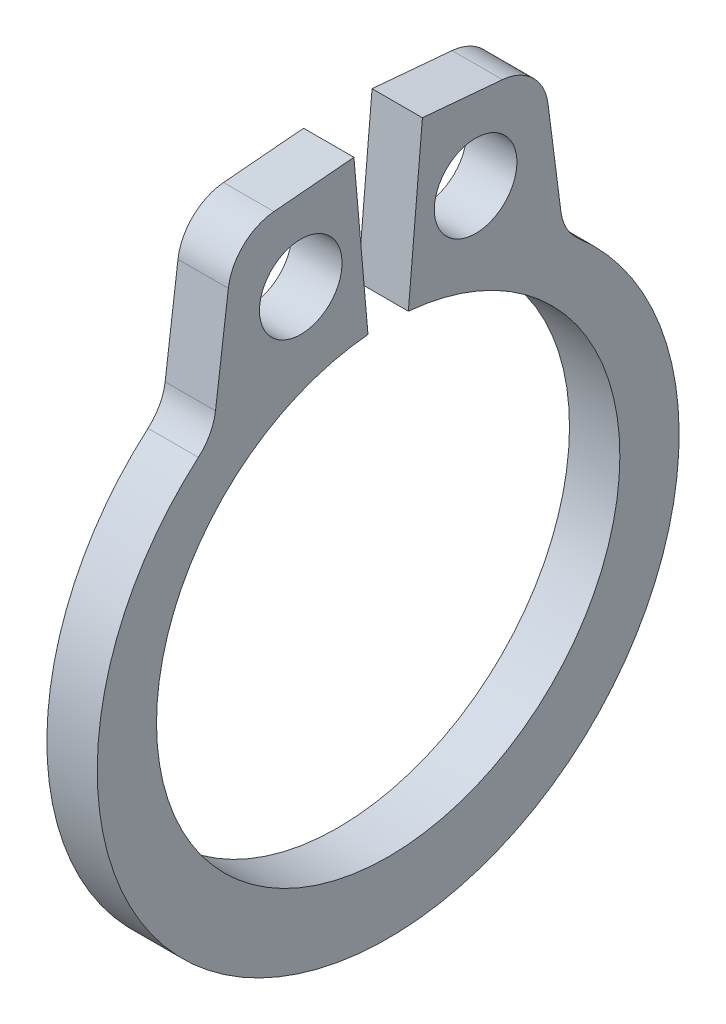
ISO-10303-21;
HEADER;
FILE_DESCRIPTION(('STEP AP214'),'2;1');
FILE_NAME('part.step','',(''),(''),'','','');
FILE_SCHEMA(('AUTOMOTIVE_DESIGN { 1 0 10303 214 1 1 1 1 }'));
ENDSEC;
DATA;
#1=APPLICATION_CONTEXT('core data for automotive mechanical design processes');
#2=APPLICATION_PROTOCOL_DEFINITION('international standard','automotive_design',2000,#1);
#3=PRODUCT_CONTEXT('',#1,'mechanical');
#4=PRODUCT('Part','Part','',(#3));
#5=PRODUCT_RELATED_PRODUCT_CATEGORY('part','',(#4));
#6=PRODUCT_DEFINITION_FORMATION('','',#4);
#7=PRODUCT_DEFINITION_CONTEXT('part definition',#1,'design');
#8=PRODUCT_DEFINITION('design','',#6,#7);
#9=PRODUCT_DEFINITION_SHAPE('','',#8);
#10=(LENGTH_UNIT() NAMED_UNIT(*) SI_UNIT(.MILLI.,.METRE.));
#11=(NAMED_UNIT(*) PLANE_ANGLE_UNIT() SI_UNIT($,.RADIAN.));
#12=(NAMED_UNIT(*) SI_UNIT($,.STERADIAN.) SOLID_ANGLE_UNIT());
#13=UNCERTAINTY_MEASURE_WITH_UNIT(LENGTH_MEASURE(1.E-05),#10,'distance_accuracy_value','');
#14=(GEOMETRIC_REPRESENTATION_CONTEXT(3) GLOBAL_UNCERTAINTY_ASSIGNED_CONTEXT((#13)) GLOBAL_UNIT_ASSIGNED_CONTEXT((#10,
#11,#12)) REPRESENTATION_CONTEXT('',''));
#15=CARTESIAN_POINT('',(0.,0.,0.));
#16=DIRECTION('',(0.,0.,1.));
#17=DIRECTION('',(1.,0.,0.));
#18=AXIS2_PLACEMENT_3D('',#15,#16,#17);
#19=CARTESIAN_POINT('',(-0.3175,0.,0.));
#20=DIRECTION('',(1.,0.,0.));
#21=DIRECTION('',(0.,0.,-1.));
#22=AXIS2_PLACEMENT_3D('',#19,#20,#21);
#23=PLANE('',#22);
#24=CARTESIAN_POINT('',(-0.3175,3.85560585041349,-1.10223251914344));
#25=DIRECTION('',(-1.,0.,0.));
#26=DIRECTION('',(0.,0.,1.));
#27=AXIS2_PLACEMENT_3D('',#24,#25,#26);
#28=CIRCLE('',#27,0.5207);
#29=CARTESIAN_POINT('',(-0.3175,3.85560585041349,-0.581532519143441));
#30=VERTEX_POINT('',#29);
#31=EDGE_CURVE('E132',#30,#30,#28,.F.);
#32=ORIENTED_EDGE('',*,*,#31,.T.);
#33=EDGE_LOOP('',(#32));
#34=FACE_BOUND('',#33,.T.);
#35=CARTESIAN_POINT('',(-0.3175,4.21328151857243,1.38546567126182));
#36=DIRECTION('',(-1.,0.,0.));
#37=DIRECTION('',(0.,0.,1.));
#38=AXIS2_PLACEMENT_3D('',#35,#36,#37);
#39=CIRCLE('',#38,0.635);
#40=CARTESIAN_POINT('',(-0.3175,4.84586515186069,1.44080956790658));
#41=VERTEX_POINT('',#40);
#42=CARTESIAN_POINT('',(-0.3175,4.2945067237745,2.01524933732492));
#43=VERTEX_POINT('',#42);
#44=EDGE_CURVE('E102',#41,#43,#39,.F.);
#45=ORIENTED_EDGE('',*,*,#44,.F.);
#46=DIRECTION('',(0.,0.0871557427476587,-0.996194698091746));
#47=VECTOR('',#46,1.);
#48=CARTESIAN_POINT('',(-0.3175,4.93415233964842,0.431682393829152));
#49=LINE('',#48,#47);
#50=CARTESIAN_POINT('',(-0.3175,4.93415233964842,0.431682393829152));
#51=VERTEX_POINT('',#50);
#52=EDGE_CURVE('E97',#41,#51,#49,.T.);
#53=ORIENTED_EDGE('',*,*,#52,.T.);
#54=DIRECTION('',(0.,-0.996194698091746,-0.0871557427476584));
#55=VECTOR('',#54,1.);
#56=CARTESIAN_POINT('',(-0.3175,2.90988471312599,0.25458192456591));
#57=LINE('',#56,#55);
#58=CARTESIAN_POINT('',(-0.3175,2.90988471312599,0.25458192456591));
#59=VERTEX_POINT('',#58);
#60=EDGE_CURVE('E129',#51,#59,#57,.T.);
#61=ORIENTED_EDGE('',*,*,#60,.T.);
#62=CARTESIAN_POINT('',(-0.3175,0.,0.));
#63=DIRECTION('',(-1.,0.,0.));
#64=DIRECTION('',(0.,0.,1.));
#65=AXIS2_PLACEMENT_3D('',#62,#63,#64);
#66=CIRCLE('',#65,2.921);
#67=CARTESIAN_POINT('',(-0.3175,2.90988471312599,-0.25458192456591));
#68=VERTEX_POINT('',#67);
#69=EDGE_CURVE('E179',#59,#68,#66,.F.);
#70=ORIENTED_EDGE('',*,*,#69,.T.);
#71=DIRECTION('',(0.,0.996194698091746,-0.0871557427476584));
#72=VECTOR('',#71,1.);
#73=CARTESIAN_POINT('',(-0.3175,2.90988471312599,-0.25458192456591));
#74=LINE('',#73,#72);
#75=CARTESIAN_POINT('',(-0.3175,4.93415233964842,-0.431682393829152));
#76=VERTEX_POINT('',#75);
#77=EDGE_CURVE('E139',#68,#76,#74,.T.);
#78=ORIENTED_EDGE('',*,*,#77,.T.);
#79=DIRECTION('',(0.,-0.0871557427476587,-0.996194698091746));
#80=VECTOR('',#79,1.);
#81=CARTESIAN_POINT('',(-0.3175,4.93415233964842,-0.431682393829152));
#82=LINE('',#81,#80);
#83=CARTESIAN_POINT('',(-0.3175,4.84586515186069,-1.44080956790658));
#84=VERTEX_POINT('',#83);
#85=EDGE_CURVE('E146',#76,#84,#82,.T.);
#86=ORIENTED_EDGE('',*,*,#85,.T.);
#87=CARTESIAN_POINT('',(-0.3175,4.21328151857243,-1.38546567126182));
#88=DIRECTION('',(-1.,0.,0.));
#89=DIRECTION('',(0.,0.,1.));
#90=AXIS2_PLACEMENT_3D('',#87,#88,#89);
#91=CIRCLE('',#90,0.635);
#92=CARTESIAN_POINT('',(-0.3175,4.2945067237745,-2.01524933732492));
#93=VERTEX_POINT('',#92);
#94=EDGE_CURVE('E149',#93,#84,#91,.F.);
#95=ORIENTED_EDGE('',*,*,#94,.F.);
#96=DIRECTION('',(0.,-0.991785300886776,-0.127913708979639));
#97=VECTOR('',#96,1.);
#98=CARTESIAN_POINT('',(-0.3175,4.80132698770098,-1.94988311372097));
#99=LINE('',#98,#97);
#100=CARTESIAN_POINT('',(-0.3175,3.03853740820642,-2.17723570007429));
#101=VERTEX_POINT('',#100);
#102=EDGE_CURVE('E152',#93,#101,#99,.T.);
#103=ORIENTED_EDGE('',*,*,#102,.T.);
#104=CARTESIAN_POINT('',(-0.3175,3.11976261340849,-2.80701936613739));
#105=DIRECTION('',(-1.,0.,0.));
#106=DIRECTION('',(0.,0.,1.));
#107=AXIS2_PLACEMENT_3D('',#104,#105,#106);
#108=CIRCLE('',#107,0.635);
#109=CARTESIAN_POINT('',(-0.3175,2.63846487393826,-2.39280023816181));
#110=VERTEX_POINT('',#109);
#111=EDGE_CURVE('E185',#101,#110,#108,.F.);
#112=ORIENTED_EDGE('',*,*,#111,.T.);
#113=CARTESIAN_POINT('',(-0.3175,-0.141825237867011,0.));
#114=DIRECTION('',(-1.,0.,0.));
#115=DIRECTION('',(0.,0.,1.));
#116=AXIS2_PLACEMENT_3D('',#113,#114,#115);
#117=CIRCLE('',#116,3.66817476213299);
#118=CARTESIAN_POINT('',(-0.3175,2.63846487393826,2.39280023816181));
#119=VERTEX_POINT('',#118);
#120=EDGE_CURVE('E187',#119,#110,#117,.F.);
#121=ORIENTED_EDGE('',*,*,#120,.F.);
#122=CARTESIAN_POINT('',(-0.3175,3.11976261340849,2.80701936613739));
#123=DIRECTION('',(-1.,0.,0.));
#124=DIRECTION('',(0.,0.,1.));
#125=AXIS2_PLACEMENT_3D('',#122,#123,#124);
#126=CIRCLE('',#125,0.635);
#127=CARTESIAN_POINT('',(-0.3175,3.03853740820642,2.17723570007429));
#128=VERTEX_POINT('',#127);
#129=EDGE_CURVE('E115',#119,#128,#126,.F.);
#130=ORIENTED_EDGE('',*,*,#129,.T.);
#131=DIRECTION('',(0.,0.991785300886776,-0.127913708979639));
#132=VECTOR('',#131,1.);
#133=CARTESIAN_POINT('',(-0.3175,4.80132698770098,1.94988311372097));
#134=LINE('',#133,#132);
#135=EDGE_CURVE('E112',#128,#43,#134,.T.);
#136=ORIENTED_EDGE('',*,*,#135,.T.);
#137=EDGE_LOOP('',(#45,#53,#61,#70,#78,#86,#95,#103,#112,#121,#130,#136));
#138=FACE_BOUND('',#137,.T.);
#139=CARTESIAN_POINT('',(-0.3175,3.85560585041349,1.10223251914344));
#140=DIRECTION('',(-1.,0.,0.));
#141=DIRECTION('',(0.,0.,1.));
#142=AXIS2_PLACEMENT_3D('',#139,#140,#141);
#143=CIRCLE('',#142,0.5207);
#144=CARTESIAN_POINT('',(-0.3175,3.85560585041349,1.62293251914344));
#145=VERTEX_POINT('',#144);
#146=EDGE_CURVE('E19',#145,#145,#143,.F.);
#147=ORIENTED_EDGE('',*,*,#146,.T.);
#148=EDGE_LOOP('',(#147));
#149=FACE_BOUND('',#148,.T.);
#150=ADVANCED_FACE('F16',(#34,#138,#149),#23,.F.);
#151=CARTESIAN_POINT('',(0.3175,3.85560585041349,1.10223251914344));
#152=DIRECTION('',(-1.,0.,0.));
#153=DIRECTION('',(0.,0.,1.));
#154=AXIS2_PLACEMENT_3D('',#151,#152,#153);
#155=CYLINDRICAL_SURFACE('',#154,0.5207);
#156=CARTESIAN_POINT('',(0.3175,3.85560585041349,1.10223251914344));
#157=DIRECTION('',(-1.,0.,0.));
#158=DIRECTION('',(0.,0.,1.));
#159=AXIS2_PLACEMENT_3D('',#156,#157,#158);
#160=CIRCLE('',#159,0.5207);
#161=CARTESIAN_POINT('',(0.3175,3.85560585041349,1.62293251914344));
#162=VERTEX_POINT('',#161);
#163=EDGE_CURVE('E174',#162,#162,#160,.T.);
#164=ORIENTED_EDGE('',*,*,#163,.F.);
#165=EDGE_LOOP('',(#164));
#166=FACE_BOUND('',#165,.T.);
#167=ORIENTED_EDGE('',*,*,#146,.F.);
#168=EDGE_LOOP('',(#167));
#169=FACE_BOUND('',#168,.T.);
#170=ADVANCED_FACE('F387',(#166,#169),#155,.F.);
#171=CARTESIAN_POINT('',(0.3175,4.93415233964842,0.431682393829152));
#172=DIRECTION('',(0.,-0.996194698091746,-0.0871557427476587));
#173=DIRECTION('',(0.,0.0871557427476587,-0.996194698091746));
#174=AXIS2_PLACEMENT_3D('',#171,#172,#173);
#175=PLANE('',#174);
#176=DIRECTION('',(-1.,0.,0.));
#177=VECTOR('',#176,1.);
#178=CARTESIAN_POINT('',(0.3175,4.84586515186069,1.44080956790658));
#179=LINE('',#178,#177);
#180=CARTESIAN_POINT('',(0.3175,4.84586515186069,1.44080956790658));
#181=VERTEX_POINT('',#180);
#182=EDGE_CURVE('E109',#181,#41,#179,.T.);
#183=ORIENTED_EDGE('',*,*,#182,.F.);
#184=DIRECTION('',(0.,-0.0871557427476588,0.996194698091746));
#185=VECTOR('',#184,1.);
#186=CARTESIAN_POINT('',(0.3175,4.93415233964842,0.431682393829152));
#187=LINE('',#186,#185);
#188=CARTESIAN_POINT('',(0.3175,4.93415233964842,0.431682393829152));
#189=VERTEX_POINT('',#188);
#190=EDGE_CURVE('E173',#189,#181,#187,.T.);
#191=ORIENTED_EDGE('',*,*,#190,.F.);
#192=DIRECTION('',(1.,0.,0.));
#193=VECTOR('',#192,1.);
#194=CARTESIAN_POINT('',(0.3175,4.93415233964842,0.431682393829152));
#195=LINE('',#194,#193);
#196=EDGE_CURVE('E133',#189,#51,#195,.F.);
#197=ORIENTED_EDGE('',*,*,#196,.T.);
#198=ORIENTED_EDGE('',*,*,#52,.F.);
#199=EDGE_LOOP('',(#183,#191,#197,#198));
#200=FACE_BOUND('',#199,.T.);
#201=ADVANCED_FACE('F237',(#200),#175,.F.);
#202=CARTESIAN_POINT('',(0.3175,4.21328151857243,1.38546567126182));
#203=DIRECTION('',(-1.,0.,0.));
#204=DIRECTION('',(0.,0.,1.));
#205=AXIS2_PLACEMENT_3D('',#202,#203,#204);
#206=CYLINDRICAL_SURFACE('',#205,0.635);
#207=ORIENTED_EDGE('',*,*,#44,.T.);
#208=DIRECTION('',(1.,0.,0.));
#209=VECTOR('',#208,1.);
#210=CARTESIAN_POINT('',(0.3175,4.2945067237745,2.01524933732492));
#211=LINE('',#210,#209);
#212=CARTESIAN_POINT('',(0.3175,4.2945067237745,2.01524933732492));
#213=VERTEX_POINT('',#212);
#214=EDGE_CURVE('E107',#43,#213,#211,.T.);
#215=ORIENTED_EDGE('',*,*,#214,.T.);
#216=CARTESIAN_POINT('',(0.3175,4.21328151857243,1.38546567126182));
#217=DIRECTION('',(-1.,0.,0.));
#218=DIRECTION('',(0.,0.,1.));
#219=AXIS2_PLACEMENT_3D('',#216,#217,#218);
#220=CIRCLE('',#219,0.635);
#221=EDGE_CURVE('E171',#181,#213,#220,.F.);
#222=ORIENTED_EDGE('',*,*,#221,.F.);
#223=ORIENTED_EDGE('',*,*,#182,.T.);
#224=EDGE_LOOP('',(#207,#215,#222,#223));
#225=FACE_BOUND('',#224,.T.);
#226=ADVANCED_FACE('F104',(#225),#206,.T.);
#227=CARTESIAN_POINT('',(0.3175,4.80132698770098,1.94988311372097));
#228=DIRECTION('',(0.,-0.127913708979639,-0.991785300886776));
#229=DIRECTION('',(0.,0.991785300886776,-0.127913708979639));
#230=AXIS2_PLACEMENT_3D('',#227,#228,#229);
#231=PLANE('',#230);
#232=DIRECTION('',(-1.,0.,0.));
#233=VECTOR('',#232,1.);
#234=CARTESIAN_POINT('',(0.3175,3.03853740820642,2.17723570007429));
#235=LINE('',#234,#233);
#236=CARTESIAN_POINT('',(0.3175,3.03853740820642,2.17723570007429));
#237=VERTEX_POINT('',#236);
#238=EDGE_CURVE('E126',#128,#237,#235,.F.);
#239=ORIENTED_EDGE('',*,*,#238,.T.);
#240=DIRECTION('',(0.,-0.991785300886776,0.127913708979639));
#241=VECTOR('',#240,1.);
#242=CARTESIAN_POINT('',(0.3175,4.2945067237745,2.01524933732492));
#243=LINE('',#242,#241);
#244=EDGE_CURVE('E121',#213,#237,#243,.T.);
#245=ORIENTED_EDGE('',*,*,#244,.F.);
#246=ORIENTED_EDGE('',*,*,#214,.F.);
#247=ORIENTED_EDGE('',*,*,#135,.F.);
#248=EDGE_LOOP('',(#239,#245,#246,#247));
#249=FACE_BOUND('',#248,.T.);
#250=ADVANCED_FACE('F119',(#249),#231,.F.);
#251=CARTESIAN_POINT('',(0.3175,3.11976261340849,2.80701936613739));
#252=DIRECTION('',(-1.,0.,0.));
#253=DIRECTION('',(0.,0.,1.));
#254=AXIS2_PLACEMENT_3D('',#251,#252,#253);
#255=CYLINDRICAL_SURFACE('',#254,0.635);
#256=ORIENTED_EDGE('',*,*,#238,.F.);
#257=ORIENTED_EDGE('',*,*,#129,.F.);
#258=DIRECTION('',(-1.,0.,0.));
#259=VECTOR('',#258,1.);
#260=CARTESIAN_POINT('',(0.3175,2.63846487393826,2.39280023816181));
#261=LINE('',#260,#259);
#262=CARTESIAN_POINT('',(0.3175,2.63846487393826,2.39280023816181));
#263=VERTEX_POINT('',#262);
#264=EDGE_CURVE('E190',#263,#119,#261,.T.);
#265=ORIENTED_EDGE('',*,*,#264,.F.);
#266=CARTESIAN_POINT('',(0.3175,3.11976261340849,2.80701936613739));
#267=DIRECTION('',(-1.,0.,0.));
#268=DIRECTION('',(0.,0.,1.));
#269=AXIS2_PLACEMENT_3D('',#266,#267,#268);
#270=CIRCLE('',#269,0.635);
#271=EDGE_CURVE('E168',#237,#263,#270,.T.);
#272=ORIENTED_EDGE('',*,*,#271,.F.);
#273=EDGE_LOOP('',(#256,#257,#265,#272));
#274=FACE_BOUND('',#273,.T.);
#275=ADVANCED_FACE('F267',(#274),#255,.F.);
#276=CARTESIAN_POINT('',(0.3175,-0.141825237867011,0.));
#277=DIRECTION('',(-1.,0.,0.));
#278=DIRECTION('',(0.,0.,1.));
#279=AXIS2_PLACEMENT_3D('',#276,#277,#278);
#280=CYLINDRICAL_SURFACE('',#279,3.66817476213299);
#281=ORIENTED_EDGE('',*,*,#120,.T.);
#282=DIRECTION('',(-1.,0.,0.));
#283=VECTOR('',#282,1.);
#284=CARTESIAN_POINT('',(0.3175,2.63846487393826,-2.39280023816181));
#285=LINE('',#284,#283);
#286=CARTESIAN_POINT('',(0.3175,2.63846487393826,-2.39280023816181));
#287=VERTEX_POINT('',#286);
#288=EDGE_CURVE('E154',#110,#287,#285,.F.);
#289=ORIENTED_EDGE('',*,*,#288,.T.);
#290=CARTESIAN_POINT('',(0.3175,-0.141825237867011,0.));
#291=DIRECTION('',(-1.,0.,0.));
#292=DIRECTION('',(0.,0.,1.));
#293=AXIS2_PLACEMENT_3D('',#290,#291,#292);
#294=CIRCLE('',#293,3.66817476213299);
#295=EDGE_CURVE('E166',#263,#287,#294,.F.);
#296=ORIENTED_EDGE('',*,*,#295,.F.);
#297=ORIENTED_EDGE('',*,*,#264,.T.);
#298=EDGE_LOOP('',(#281,#289,#296,#297));
#299=FACE_BOUND('',#298,.T.);
#300=ADVANCED_FACE('F265',(#299),#280,.T.);
#301=CARTESIAN_POINT('',(0.3175,3.11976261340849,-2.80701936613739));
#302=DIRECTION('',(-1.,0.,0.));
#303=DIRECTION('',(0.,0.,1.));
#304=AXIS2_PLACEMENT_3D('',#301,#302,#303);
#305=CYLINDRICAL_SURFACE('',#304,0.635);
#306=ORIENTED_EDGE('',*,*,#288,.F.);
#307=ORIENTED_EDGE('',*,*,#111,.F.);
#308=DIRECTION('',(1.,0.,0.));
#309=VECTOR('',#308,1.);
#310=CARTESIAN_POINT('',(0.3175,3.03853740820642,-2.17723570007429));
#311=LINE('',#310,#309);
#312=CARTESIAN_POINT('',(0.3175,3.03853740820642,-2.17723570007429));
#313=VERTEX_POINT('',#312);
#314=EDGE_CURVE('E153',#101,#313,#311,.T.);
#315=ORIENTED_EDGE('',*,*,#314,.T.);
#316=CARTESIAN_POINT('',(0.3175,3.11976261340849,-2.80701936613739));
#317=DIRECTION('',(-1.,0.,0.));
#318=DIRECTION('',(0.,0.,1.));
#319=AXIS2_PLACEMENT_3D('',#316,#317,#318);
#320=CIRCLE('',#319,0.635);
#321=EDGE_CURVE('E163',#287,#313,#320,.T.);
#322=ORIENTED_EDGE('',*,*,#321,.F.);
#323=EDGE_LOOP('',(#306,#307,#315,#322));
#324=FACE_BOUND('',#323,.T.);
#325=ADVANCED_FACE('F263',(#324),#305,.F.);
#326=CARTESIAN_POINT('',(0.3175,4.80132698770098,-1.94988311372097));
#327=DIRECTION('',(0.,-0.127913708979639,0.991785300886776));
#328=DIRECTION('',(0.,-0.991785300886776,-0.127913708979639));
#329=AXIS2_PLACEMENT_3D('',#326,#327,#328);
#330=PLANE('',#329);
#331=ORIENTED_EDGE('',*,*,#314,.F.);
#332=ORIENTED_EDGE('',*,*,#102,.F.);
#333=DIRECTION('',(-1.,0.,0.));
#334=VECTOR('',#333,1.);
#335=CARTESIAN_POINT('',(0.3175,4.2945067237745,-2.01524933732492));
#336=LINE('',#335,#334);
#337=CARTESIAN_POINT('',(0.3175,4.2945067237745,-2.01524933732492));
#338=VERTEX_POINT('',#337);
#339=EDGE_CURVE('E184',#338,#93,#336,.T.);
#340=ORIENTED_EDGE('',*,*,#339,.F.);
#341=DIRECTION('',(0.,0.991785300886776,0.127913708979639));
#342=VECTOR('',#341,1.);
#343=CARTESIAN_POINT('',(0.3175,3.03853740820642,-2.17723570007429));
#344=LINE('',#343,#342);
#345=EDGE_CURVE('E162',#313,#338,#344,.T.);
#346=ORIENTED_EDGE('',*,*,#345,.F.);
#347=EDGE_LOOP('',(#331,#332,#340,#346));
#348=FACE_BOUND('',#347,.T.);
#349=ADVANCED_FACE('F259',(#348),#330,.F.);
#350=CARTESIAN_POINT('',(0.3175,4.21328151857243,-1.38546567126182));
#351=DIRECTION('',(-1.,0.,0.));
#352=DIRECTION('',(0.,0.,1.));
#353=AXIS2_PLACEMENT_3D('',#350,#351,#352);
#354=CYLINDRICAL_SURFACE('',#353,0.635);
#355=ORIENTED_EDGE('',*,*,#94,.T.);
#356=DIRECTION('',(1.,0.,0.));
#357=VECTOR('',#356,1.);
#358=CARTESIAN_POINT('',(0.3175,4.84586515186069,-1.44080956790658));
#359=LINE('',#358,#357);
#360=CARTESIAN_POINT('',(0.3175,4.84586515186069,-1.44080956790658));
#361=VERTEX_POINT('',#360);
#362=EDGE_CURVE('E148',#84,#361,#359,.T.);
#363=ORIENTED_EDGE('',*,*,#362,.T.);
#364=CARTESIAN_POINT('',(0.3175,4.21328151857243,-1.38546567126182));
#365=DIRECTION('',(-1.,0.,0.));
#366=DIRECTION('',(0.,0.,1.));
#367=AXIS2_PLACEMENT_3D('',#364,#365,#366);
#368=CIRCLE('',#367,0.635);
#369=EDGE_CURVE('E158',#338,#361,#368,.F.);
#370=ORIENTED_EDGE('',*,*,#369,.F.);
#371=ORIENTED_EDGE('',*,*,#339,.T.);
#372=EDGE_LOOP('',(#355,#363,#370,#371));
#373=FACE_BOUND('',#372,.T.);
#374=ADVANCED_FACE('F254',(#373),#354,.T.);
#375=CARTESIAN_POINT('',(0.3175,4.93415233964842,-0.431682393829152));
#376=DIRECTION('',(0.,-0.996194698091746,0.0871557427476587));
#377=DIRECTION('',(0.,-0.0871557427476587,-0.996194698091746));
#378=AXIS2_PLACEMENT_3D('',#375,#376,#377);
#379=PLANE('',#378);
#380=ORIENTED_EDGE('',*,*,#362,.F.);
#381=ORIENTED_EDGE('',*,*,#85,.F.);
#382=DIRECTION('',(1.,0.,0.));
#383=VECTOR('',#382,1.);
#384=CARTESIAN_POINT('',(0.3175,4.93415233964842,-0.431682393829152));
#385=LINE('',#384,#383);
#386=CARTESIAN_POINT('',(0.3175,4.93415233964842,-0.431682393829152));
#387=VERTEX_POINT('',#386);
#388=EDGE_CURVE('E143',#76,#387,#385,.T.);
#389=ORIENTED_EDGE('',*,*,#388,.T.);
#390=DIRECTION('',(0.,0.0871557427476588,0.996194698091746));
#391=VECTOR('',#390,1.);
#392=CARTESIAN_POINT('',(0.3175,4.84586515186069,-1.44080956790658));
#393=LINE('',#392,#391);
#394=EDGE_CURVE('E161',#361,#387,#393,.T.);
#395=ORIENTED_EDGE('',*,*,#394,.F.);
#396=EDGE_LOOP('',(#380,#381,#389,#395));
#397=FACE_BOUND('',#396,.T.);
#398=ADVANCED_FACE('F251',(#397),#379,.F.);
#399=CARTESIAN_POINT('',(0.3175,2.90988471312599,-0.25458192456591));
#400=DIRECTION('',(0.,-0.0871557427476584,-0.996194698091746));
#401=DIRECTION('',(0.,0.996194698091746,-0.0871557427476584));
#402=AXIS2_PLACEMENT_3D('',#399,#400,#401);
#403=PLANE('',#402);
#404=DIRECTION('',(-1.,0.,0.));
#405=VECTOR('',#404,1.);
#406=CARTESIAN_POINT('',(0.3175,2.90988471312599,-0.25458192456591));
#407=LINE('',#406,#405);
#408=CARTESIAN_POINT('',(0.3175,2.90988471312599,-0.25458192456591));
#409=VERTEX_POINT('',#408);
#410=EDGE_CURVE('E142',#68,#409,#407,.F.);
#411=ORIENTED_EDGE('',*,*,#410,.T.);
#412=DIRECTION('',(0.,-0.996194698091746,0.0871557427476584));
#413=VECTOR('',#412,1.);
#414=CARTESIAN_POINT('',(0.3175,4.93415233964842,-0.431682393829152));
#415=LINE('',#414,#413);
#416=EDGE_CURVE('E157',#387,#409,#415,.T.);
#417=ORIENTED_EDGE('',*,*,#416,.F.);
#418=ORIENTED_EDGE('',*,*,#388,.F.);
#419=ORIENTED_EDGE('',*,*,#77,.F.);
#420=EDGE_LOOP('',(#411,#417,#418,#419));
#421=FACE_BOUND('',#420,.T.);
#422=ADVANCED_FACE('F243',(#421),#403,.F.);
#423=CARTESIAN_POINT('',(0.3175,0.,0.));
#424=DIRECTION('',(-1.,0.,0.));
#425=DIRECTION('',(0.,0.,1.));
#426=AXIS2_PLACEMENT_3D('',#423,#424,#425);
#427=CYLINDRICAL_SURFACE('',#426,2.921);
#428=DIRECTION('',(1.,0.,0.));
#429=VECTOR('',#428,1.);
#430=CARTESIAN_POINT('',(0.3175,2.90988471312599,0.25458192456591));
#431=LINE('',#430,#429);
#432=CARTESIAN_POINT('',(0.3175,2.90988471312599,0.25458192456591));
#433=VERTEX_POINT('',#432);
#434=EDGE_CURVE('E181',#59,#433,#431,.T.);
#435=ORIENTED_EDGE('',*,*,#434,.T.);
#436=CARTESIAN_POINT('',(0.3175,0.,0.));
#437=DIRECTION('',(-1.,0.,0.));
#438=DIRECTION('',(0.,0.,1.));
#439=AXIS2_PLACEMENT_3D('',#436,#437,#438);
#440=CIRCLE('',#439,2.921);
#441=EDGE_CURVE('E34',#409,#433,#440,.T.);
#442=ORIENTED_EDGE('',*,*,#441,.F.);
#443=ORIENTED_EDGE('',*,*,#410,.F.);
#444=ORIENTED_EDGE('',*,*,#69,.F.);
#445=EDGE_LOOP('',(#435,#442,#443,#444));
#446=FACE_BOUND('',#445,.T.);
#447=ADVANCED_FACE('F245',(#446),#427,.F.);
#448=CARTESIAN_POINT('',(0.3175,2.90988471312599,0.25458192456591));
#449=DIRECTION('',(0.,-0.0871557427476584,0.996194698091746));
#450=DIRECTION('',(0.,-0.996194698091746,-0.0871557427476584));
#451=AXIS2_PLACEMENT_3D('',#448,#449,#450);
#452=PLANE('',#451);
#453=ORIENTED_EDGE('',*,*,#196,.F.);
#454=DIRECTION('',(0.,0.996194698091746,0.0871557427476584));
#455=VECTOR('',#454,1.);
#456=CARTESIAN_POINT('',(0.3175,2.90988471312599,0.25458192456591));
#457=LINE('',#456,#455);
#458=EDGE_CURVE('E25',#433,#189,#457,.T.);
#459=ORIENTED_EDGE('',*,*,#458,.F.);
#460=ORIENTED_EDGE('',*,*,#434,.F.);
#461=ORIENTED_EDGE('',*,*,#60,.F.);
#462=EDGE_LOOP('',(#453,#459,#460,#461));
#463=FACE_BOUND('',#462,.T.);
#464=ADVANCED_FACE('F235',(#463),#452,.F.);
#465=CARTESIAN_POINT('',(0.3175,3.85560585041349,-1.10223251914344));
#466=DIRECTION('',(-1.,0.,0.));
#467=DIRECTION('',(0.,0.,1.));
#468=AXIS2_PLACEMENT_3D('',#465,#466,#467);
#469=CYLINDRICAL_SURFACE('',#468,0.5207);
#470=CARTESIAN_POINT('',(0.3175,3.85560585041349,-1.10223251914344));
#471=DIRECTION('',(-1.,0.,0.));
#472=DIRECTION('',(0.,0.,1.));
#473=AXIS2_PLACEMENT_3D('',#470,#471,#472);
#474=CIRCLE('',#473,0.5207);
#475=CARTESIAN_POINT('',(0.3175,3.85560585041349,-0.581532519143441));
#476=VERTEX_POINT('',#475);
#477=EDGE_CURVE('E11',#476,#476,#474,.T.);
#478=ORIENTED_EDGE('',*,*,#477,.F.);
#479=EDGE_LOOP('',(#478));
#480=FACE_BOUND('',#479,.T.);
#481=ORIENTED_EDGE('',*,*,#31,.F.);
#482=EDGE_LOOP('',(#481));
#483=FACE_BOUND('',#482,.T.);
#484=ADVANCED_FACE('F278',(#480,#483),#469,.F.);
#485=CARTESIAN_POINT('',(0.3175,0.,0.));
#486=DIRECTION('',(1.,0.,0.));
#487=DIRECTION('',(0.,0.,-1.));
#488=AXIS2_PLACEMENT_3D('',#485,#486,#487);
#489=PLANE('',#488);
#490=ORIENTED_EDGE('',*,*,#477,.T.);
#491=EDGE_LOOP('',(#490));
#492=FACE_BOUND('',#491,.T.);
#493=ORIENTED_EDGE('',*,*,#441,.T.);
#494=ORIENTED_EDGE('',*,*,#458,.T.);
#495=ORIENTED_EDGE('',*,*,#190,.T.);
#496=ORIENTED_EDGE('',*,*,#221,.T.);
#497=ORIENTED_EDGE('',*,*,#244,.T.);
#498=ORIENTED_EDGE('',*,*,#271,.T.);
#499=ORIENTED_EDGE('',*,*,#295,.T.);
#500=ORIENTED_EDGE('',*,*,#321,.T.);
#501=ORIENTED_EDGE('',*,*,#345,.T.);
#502=ORIENTED_EDGE('',*,*,#369,.T.);
#503=ORIENTED_EDGE('',*,*,#394,.T.);
#504=ORIENTED_EDGE('',*,*,#416,.T.);
#505=EDGE_LOOP('',(#493,#494,#495,#496,#497,#498,#499,#500,#501,#502,#503,#504));
#506=FACE_BOUND('',#505,.T.);
#507=ORIENTED_EDGE('',*,*,#163,.T.);
#508=EDGE_LOOP('',(#507));
#509=FACE_BOUND('',#508,.T.);
#510=ADVANCED_FACE('F228',(#492,#506,#509),#489,.T.);
#511=CLOSED_SHELL('',(#150,#170,#201,#226,#250,#275,#300,#325,#349,#374,#398,#422,#447,#464,
#484,#510));
#512=MANIFOLD_SOLID_BREP('B1',#511);
#513=ADVANCED_BREP_SHAPE_REPRESENTATION('',(#18,#512),#14);
#514=SHAPE_DEFINITION_REPRESENTATION(#9,#513);
ENDSEC;
END-ISO-10303-21;
